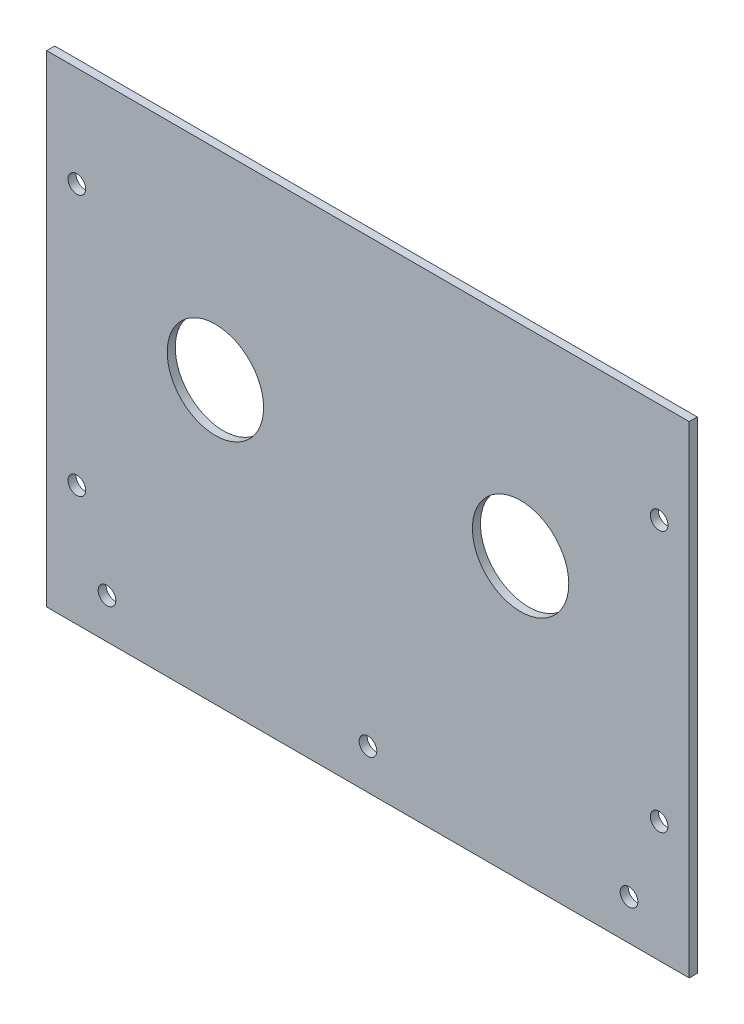
ISO-10303-21;
HEADER;
FILE_DESCRIPTION(('STEP AP214'),'2;1');
FILE_NAME('part.step','',(''),(''),'','','');
FILE_SCHEMA(('AUTOMOTIVE_DESIGN { 1 0 10303 214 1 1 1 1 }'));
ENDSEC;
DATA;
#1=APPLICATION_CONTEXT('core data for automotive mechanical design processes');
#2=APPLICATION_PROTOCOL_DEFINITION('international standard','automotive_design',2000,#1);
#3=PRODUCT_CONTEXT('',#1,'mechanical');
#4=PRODUCT('Part','Part','',(#3));
#5=PRODUCT_RELATED_PRODUCT_CATEGORY('part','',(#4));
#6=PRODUCT_DEFINITION_FORMATION('','',#4);
#7=PRODUCT_DEFINITION_CONTEXT('part definition',#1,'design');
#8=PRODUCT_DEFINITION('design','',#6,#7);
#9=PRODUCT_DEFINITION_SHAPE('','',#8);
#10=(LENGTH_UNIT() NAMED_UNIT(*) SI_UNIT(.MILLI.,.METRE.));
#11=(NAMED_UNIT(*) PLANE_ANGLE_UNIT() SI_UNIT($,.RADIAN.));
#12=(NAMED_UNIT(*) SI_UNIT($,.STERADIAN.) SOLID_ANGLE_UNIT());
#13=UNCERTAINTY_MEASURE_WITH_UNIT(LENGTH_MEASURE(1.E-05),#10,'distance_accuracy_value','');
#14=(GEOMETRIC_REPRESENTATION_CONTEXT(3) GLOBAL_UNCERTAINTY_ASSIGNED_CONTEXT((#13)) GLOBAL_UNIT_ASSIGNED_CONTEXT((#10,
#11,#12)) REPRESENTATION_CONTEXT('',''));
#15=CARTESIAN_POINT('',(0.,0.,0.));
#16=DIRECTION('',(0.,0.,1.));
#17=DIRECTION('',(1.,0.,0.));
#18=AXIS2_PLACEMENT_3D('',#15,#16,#17);
#19=CARTESIAN_POINT('',(80.,60.,2.));
#20=DIRECTION('',(-1.,0.,0.));
#21=DIRECTION('',(0.,-1.,0.));
#22=AXIS2_PLACEMENT_3D('',#19,#20,#21);
#23=PLANE('',#22);
#24=DIRECTION('',(0.,1.,0.));
#25=VECTOR('',#24,1.);
#26=CARTESIAN_POINT('',(80.,60.,0.));
#27=LINE('',#26,#25);
#28=CARTESIAN_POINT('',(80.,-60.,0.));
#29=VERTEX_POINT('',#28);
#30=CARTESIAN_POINT('',(80.,60.,0.));
#31=VERTEX_POINT('',#30);
#32=EDGE_CURVE('E109',#29,#31,#27,.T.);
#33=ORIENTED_EDGE('',*,*,#32,.T.);
#34=DIRECTION('',(0.,0.,-1.));
#35=VECTOR('',#34,1.);
#36=CARTESIAN_POINT('',(80.,60.,2.));
#37=LINE('',#36,#35);
#38=CARTESIAN_POINT('',(80.,60.,2.));
#39=VERTEX_POINT('',#38);
#40=EDGE_CURVE('E11',#39,#31,#37,.T.);
#41=ORIENTED_EDGE('',*,*,#40,.F.);
#42=DIRECTION('',(0.,1.,0.));
#43=VECTOR('',#42,1.);
#44=CARTESIAN_POINT('',(80.,60.,2.));
#45=LINE('',#44,#43);
#46=CARTESIAN_POINT('',(80.,-60.,2.));
#47=VERTEX_POINT('',#46);
#48=EDGE_CURVE('E92',#47,#39,#45,.T.);
#49=ORIENTED_EDGE('',*,*,#48,.F.);
#50=DIRECTION('',(0.,0.,-1.));
#51=VECTOR('',#50,1.);
#52=CARTESIAN_POINT('',(80.,-60.,2.));
#53=LINE('',#52,#51);
#54=EDGE_CURVE('E105',#47,#29,#53,.T.);
#55=ORIENTED_EDGE('',*,*,#54,.T.);
#56=EDGE_LOOP('',(#33,#41,#49,#55));
#57=FACE_BOUND('',#56,.T.);
#58=ADVANCED_FACE('F38',(#57),#23,.F.);
#59=CARTESIAN_POINT('',(-80.,60.,2.));
#60=DIRECTION('',(0.,-1.,0.));
#61=DIRECTION('',(0.,0.,-1.));
#62=AXIS2_PLACEMENT_3D('',#59,#60,#61);
#63=PLANE('',#62);
#64=DIRECTION('',(-1.,0.,0.));
#65=VECTOR('',#64,1.);
#66=CARTESIAN_POINT('',(-80.,60.,0.));
#67=LINE('',#66,#65);
#68=CARTESIAN_POINT('',(-80.,60.,0.));
#69=VERTEX_POINT('',#68);
#70=EDGE_CURVE('E97',#31,#69,#67,.T.);
#71=ORIENTED_EDGE('',*,*,#70,.T.);
#72=DIRECTION('',(0.,0.,-1.));
#73=VECTOR('',#72,1.);
#74=CARTESIAN_POINT('',(-80.,60.,2.));
#75=LINE('',#74,#73);
#76=CARTESIAN_POINT('',(-80.,60.,2.));
#77=VERTEX_POINT('',#76);
#78=EDGE_CURVE('E48',#77,#69,#75,.T.);
#79=ORIENTED_EDGE('',*,*,#78,.F.);
#80=DIRECTION('',(-1.,0.,0.));
#81=VECTOR('',#80,1.);
#82=CARTESIAN_POINT('',(-80.,60.,2.));
#83=LINE('',#82,#81);
#84=EDGE_CURVE('E87',#39,#77,#83,.T.);
#85=ORIENTED_EDGE('',*,*,#84,.F.);
#86=ORIENTED_EDGE('',*,*,#40,.T.);
#87=EDGE_LOOP('',(#71,#79,#85,#86));
#88=FACE_BOUND('',#87,.T.);
#89=ADVANCED_FACE('F96',(#88),#63,.F.);
#90=CARTESIAN_POINT('',(-80.,60.,2.));
#91=DIRECTION('',(1.,0.,0.));
#92=DIRECTION('',(0.,1.,0.));
#93=AXIS2_PLACEMENT_3D('',#90,#91,#92);
#94=PLANE('',#93);
#95=DIRECTION('',(0.,-1.,0.));
#96=VECTOR('',#95,1.);
#97=CARTESIAN_POINT('',(-80.,60.,0.));
#98=LINE('',#97,#96);
#99=CARTESIAN_POINT('',(-80.,-60.,0.));
#100=VERTEX_POINT('',#99);
#101=EDGE_CURVE('E74',#69,#100,#98,.T.);
#102=ORIENTED_EDGE('',*,*,#101,.T.);
#103=DIRECTION('',(0.,0.,-1.));
#104=VECTOR('',#103,1.);
#105=CARTESIAN_POINT('',(-80.,-60.,2.));
#106=LINE('',#105,#104);
#107=CARTESIAN_POINT('',(-80.,-60.,2.));
#108=VERTEX_POINT('',#107);
#109=EDGE_CURVE('E99',#108,#100,#106,.T.);
#110=ORIENTED_EDGE('',*,*,#109,.F.);
#111=DIRECTION('',(0.,-1.,0.));
#112=VECTOR('',#111,1.);
#113=CARTESIAN_POINT('',(-80.,60.,2.));
#114=LINE('',#113,#112);
#115=EDGE_CURVE('E90',#77,#108,#114,.T.);
#116=ORIENTED_EDGE('',*,*,#115,.F.);
#117=ORIENTED_EDGE('',*,*,#78,.T.);
#118=EDGE_LOOP('',(#102,#110,#116,#117));
#119=FACE_BOUND('',#118,.T.);
#120=ADVANCED_FACE('F101',(#119),#94,.F.);
#121=CARTESIAN_POINT('',(-80.,-60.,2.));
#122=DIRECTION('',(0.,1.,0.));
#123=DIRECTION('',(0.,0.,1.));
#124=AXIS2_PLACEMENT_3D('',#121,#122,#123);
#125=PLANE('',#124);
#126=DIRECTION('',(1.,0.,0.));
#127=VECTOR('',#126,1.);
#128=CARTESIAN_POINT('',(-80.,-60.,0.));
#129=LINE('',#128,#127);
#130=EDGE_CURVE('E80',#100,#29,#129,.T.);
#131=ORIENTED_EDGE('',*,*,#130,.T.);
#132=ORIENTED_EDGE('',*,*,#54,.F.);
#133=DIRECTION('',(1.,0.,0.));
#134=VECTOR('',#133,1.);
#135=CARTESIAN_POINT('',(-80.,-60.,2.));
#136=LINE('',#135,#134);
#137=EDGE_CURVE('E57',#108,#47,#136,.T.);
#138=ORIENTED_EDGE('',*,*,#137,.F.);
#139=ORIENTED_EDGE('',*,*,#109,.T.);
#140=EDGE_LOOP('',(#131,#132,#138,#139));
#141=FACE_BOUND('',#140,.T.);
#142=ADVANCED_FACE('F208',(#141),#125,.F.);
#143=CARTESIAN_POINT('',(0.,0.,2.));
#144=DIRECTION('',(0.,0.,1.));
#145=DIRECTION('',(1.,0.,0.));
#146=AXIS2_PLACEMENT_3D('',#143,#144,#145);
#147=PLANE('',#146);
#148=CARTESIAN_POINT('',(-72.5,-30.,2.));
#149=DIRECTION('',(0.,0.,1.));
#150=DIRECTION('',(1.,0.,0.));
#151=AXIS2_PLACEMENT_3D('',#148,#149,#150);
#152=CIRCLE('',#151,2.2);
#153=CARTESIAN_POINT('',(-70.3,-30.,2.));
#154=VERTEX_POINT('',#153);
#155=EDGE_CURVE('E190',#154,#154,#152,.T.);
#156=ORIENTED_EDGE('',*,*,#155,.F.);
#157=EDGE_LOOP('',(#156));
#158=FACE_BOUND('',#157,.T.);
#159=CARTESIAN_POINT('',(-72.5,35.,2.));
#160=DIRECTION('',(0.,0.,1.));
#161=DIRECTION('',(1.,0.,0.));
#162=AXIS2_PLACEMENT_3D('',#159,#160,#161);
#163=CIRCLE('',#162,2.20000000000001);
#164=CARTESIAN_POINT('',(-70.3,35.,2.));
#165=VERTEX_POINT('',#164);
#166=EDGE_CURVE('E194',#165,#165,#163,.T.);
#167=ORIENTED_EDGE('',*,*,#166,.F.);
#168=EDGE_LOOP('',(#167));
#169=FACE_BOUND('',#168,.T.);
#170=CARTESIAN_POINT('',(72.5,35.,2.));
#171=DIRECTION('',(0.,0.,1.));
#172=DIRECTION('',(1.,0.,0.));
#173=AXIS2_PLACEMENT_3D('',#170,#171,#172);
#174=CIRCLE('',#173,2.2);
#175=CARTESIAN_POINT('',(74.7,35.,2.));
#176=VERTEX_POINT('',#175);
#177=EDGE_CURVE('E189',#176,#176,#174,.T.);
#178=ORIENTED_EDGE('',*,*,#177,.F.);
#179=EDGE_LOOP('',(#178));
#180=FACE_BOUND('',#179,.T.);
#181=CARTESIAN_POINT('',(72.5,-30.,2.));
#182=DIRECTION('',(0.,0.,1.));
#183=DIRECTION('',(1.,0.,0.));
#184=AXIS2_PLACEMENT_3D('',#181,#182,#183);
#185=CIRCLE('',#184,2.2);
#186=CARTESIAN_POINT('',(74.7,-30.,2.));
#187=VERTEX_POINT('',#186);
#188=EDGE_CURVE('E129',#187,#187,#185,.T.);
#189=ORIENTED_EDGE('',*,*,#188,.F.);
#190=EDGE_LOOP('',(#189));
#191=FACE_BOUND('',#190,.T.);
#192=CARTESIAN_POINT('',(-38.,10.,2.));
#193=DIRECTION('',(0.,0.,1.));
#194=DIRECTION('',(1.,0.,0.));
#195=AXIS2_PLACEMENT_3D('',#192,#193,#194);
#196=CIRCLE('',#195,12.);
#197=CARTESIAN_POINT('',(-26.,10.,2.));
#198=VERTEX_POINT('',#197);
#199=EDGE_CURVE('E154',#198,#198,#196,.T.);
#200=ORIENTED_EDGE('',*,*,#199,.F.);
#201=EDGE_LOOP('',(#200));
#202=FACE_BOUND('',#201,.T.);
#203=CARTESIAN_POINT('',(65.,-50.,2.));
#204=DIRECTION('',(0.,0.,1.));
#205=DIRECTION('',(1.,0.,0.));
#206=AXIS2_PLACEMENT_3D('',#203,#204,#205);
#207=CIRCLE('',#206,2.20000000000001);
#208=CARTESIAN_POINT('',(67.2,-50.,2.));
#209=VERTEX_POINT('',#208);
#210=EDGE_CURVE('E163',#209,#209,#207,.T.);
#211=ORIENTED_EDGE('',*,*,#210,.F.);
#212=EDGE_LOOP('',(#211));
#213=FACE_BOUND('',#212,.T.);
#214=CARTESIAN_POINT('',(0.,-50.,2.));
#215=DIRECTION('',(0.,0.,1.));
#216=DIRECTION('',(1.,0.,0.));
#217=AXIS2_PLACEMENT_3D('',#214,#215,#216);
#218=CIRCLE('',#217,2.2);
#219=CARTESIAN_POINT('',(2.20000000000001,-50.,2.));
#220=VERTEX_POINT('',#219);
#221=EDGE_CURVE('E171',#220,#220,#218,.T.);
#222=ORIENTED_EDGE('',*,*,#221,.F.);
#223=EDGE_LOOP('',(#222));
#224=FACE_BOUND('',#223,.T.);
#225=CARTESIAN_POINT('',(-65.,-50.,2.));
#226=DIRECTION('',(0.,0.,1.));
#227=DIRECTION('',(1.,0.,0.));
#228=AXIS2_PLACEMENT_3D('',#225,#226,#227);
#229=CIRCLE('',#228,2.2);
#230=CARTESIAN_POINT('',(-62.8,-50.,2.));
#231=VERTEX_POINT('',#230);
#232=EDGE_CURVE('E144',#231,#231,#229,.T.);
#233=ORIENTED_EDGE('',*,*,#232,.F.);
#234=EDGE_LOOP('',(#233));
#235=FACE_BOUND('',#234,.T.);
#236=CARTESIAN_POINT('',(38.,10.,2.));
#237=DIRECTION('',(0.,0.,1.));
#238=DIRECTION('',(1.,0.,0.));
#239=AXIS2_PLACEMENT_3D('',#236,#237,#238);
#240=CIRCLE('',#239,12.);
#241=CARTESIAN_POINT('',(50.,10.,2.));
#242=VERTEX_POINT('',#241);
#243=EDGE_CURVE('E158',#242,#242,#240,.T.);
#244=ORIENTED_EDGE('',*,*,#243,.F.);
#245=EDGE_LOOP('',(#244));
#246=FACE_BOUND('',#245,.T.);
#247=ORIENTED_EDGE('',*,*,#48,.T.);
#248=ORIENTED_EDGE('',*,*,#84,.T.);
#249=ORIENTED_EDGE('',*,*,#115,.T.);
#250=ORIENTED_EDGE('',*,*,#137,.T.);
#251=EDGE_LOOP('',(#247,#248,#249,#250));
#252=FACE_BOUND('',#251,.T.);
#253=ADVANCED_FACE('F88',(#158,#169,#180,#191,#202,#213,#224,#235,#246,#252),#147,.T.);
#254=CARTESIAN_POINT('',(0.,0.,0.));
#255=DIRECTION('',(0.,0.,1.));
#256=DIRECTION('',(1.,0.,0.));
#257=AXIS2_PLACEMENT_3D('',#254,#255,#256);
#258=PLANE('',#257);
#259=CARTESIAN_POINT('',(-72.5,-30.,0.));
#260=DIRECTION('',(0.,0.,1.));
#261=DIRECTION('',(1.,0.,0.));
#262=AXIS2_PLACEMENT_3D('',#259,#260,#261);
#263=CIRCLE('',#262,2.2);
#264=CARTESIAN_POINT('',(-70.3,-30.,0.));
#265=VERTEX_POINT('',#264);
#266=EDGE_CURVE('E41',#265,#265,#263,.T.);
#267=ORIENTED_EDGE('',*,*,#266,.T.);
#268=EDGE_LOOP('',(#267));
#269=FACE_BOUND('',#268,.T.);
#270=CARTESIAN_POINT('',(-72.5,35.,0.));
#271=DIRECTION('',(0.,0.,1.));
#272=DIRECTION('',(1.,0.,0.));
#273=AXIS2_PLACEMENT_3D('',#270,#271,#272);
#274=CIRCLE('',#273,2.20000000000001);
#275=CARTESIAN_POINT('',(-70.3,35.,0.));
#276=VERTEX_POINT('',#275);
#277=EDGE_CURVE('E132',#276,#276,#274,.T.);
#278=ORIENTED_EDGE('',*,*,#277,.T.);
#279=EDGE_LOOP('',(#278));
#280=FACE_BOUND('',#279,.T.);
#281=CARTESIAN_POINT('',(72.5,35.,0.));
#282=DIRECTION('',(0.,0.,1.));
#283=DIRECTION('',(1.,0.,0.));
#284=AXIS2_PLACEMENT_3D('',#281,#282,#283);
#285=CIRCLE('',#284,2.2);
#286=CARTESIAN_POINT('',(74.7,35.,0.));
#287=VERTEX_POINT('',#286);
#288=EDGE_CURVE('E128',#287,#287,#285,.T.);
#289=ORIENTED_EDGE('',*,*,#288,.T.);
#290=EDGE_LOOP('',(#289));
#291=FACE_BOUND('',#290,.T.);
#292=CARTESIAN_POINT('',(72.5,-30.,0.));
#293=DIRECTION('',(0.,0.,1.));
#294=DIRECTION('',(1.,0.,0.));
#295=AXIS2_PLACEMENT_3D('',#292,#293,#294);
#296=CIRCLE('',#295,2.2);
#297=CARTESIAN_POINT('',(74.7,-30.,0.));
#298=VERTEX_POINT('',#297);
#299=EDGE_CURVE('E124',#298,#298,#296,.T.);
#300=ORIENTED_EDGE('',*,*,#299,.T.);
#301=EDGE_LOOP('',(#300));
#302=FACE_BOUND('',#301,.T.);
#303=CARTESIAN_POINT('',(-38.,10.,0.));
#304=DIRECTION('',(0.,0.,1.));
#305=DIRECTION('',(1.,0.,0.));
#306=AXIS2_PLACEMENT_3D('',#303,#304,#305);
#307=CIRCLE('',#306,12.);
#308=CARTESIAN_POINT('',(-26.,10.,0.));
#309=VERTEX_POINT('',#308);
#310=EDGE_CURVE('E159',#309,#309,#307,.T.);
#311=ORIENTED_EDGE('',*,*,#310,.T.);
#312=EDGE_LOOP('',(#311));
#313=FACE_BOUND('',#312,.T.);
#314=CARTESIAN_POINT('',(65.,-50.,0.));
#315=DIRECTION('',(0.,0.,1.));
#316=DIRECTION('',(1.,0.,0.));
#317=AXIS2_PLACEMENT_3D('',#314,#315,#316);
#318=CIRCLE('',#317,2.20000000000001);
#319=CARTESIAN_POINT('',(67.2,-50.,0.));
#320=VERTEX_POINT('',#319);
#321=EDGE_CURVE('E167',#320,#320,#318,.T.);
#322=ORIENTED_EDGE('',*,*,#321,.T.);
#323=EDGE_LOOP('',(#322));
#324=FACE_BOUND('',#323,.T.);
#325=CARTESIAN_POINT('',(0.,-50.,0.));
#326=DIRECTION('',(0.,0.,1.));
#327=DIRECTION('',(1.,0.,0.));
#328=AXIS2_PLACEMENT_3D('',#325,#326,#327);
#329=CIRCLE('',#328,2.2);
#330=CARTESIAN_POINT('',(2.20000000000001,-50.,0.));
#331=VERTEX_POINT('',#330);
#332=EDGE_CURVE('E150',#331,#331,#329,.T.);
#333=ORIENTED_EDGE('',*,*,#332,.T.);
#334=EDGE_LOOP('',(#333));
#335=FACE_BOUND('',#334,.T.);
#336=CARTESIAN_POINT('',(-65.,-50.,0.));
#337=DIRECTION('',(0.,0.,1.));
#338=DIRECTION('',(1.,0.,0.));
#339=AXIS2_PLACEMENT_3D('',#336,#337,#338);
#340=CIRCLE('',#339,2.2);
#341=CARTESIAN_POINT('',(-62.8,-50.,0.));
#342=VERTEX_POINT('',#341);
#343=EDGE_CURVE('E139',#342,#342,#340,.T.);
#344=ORIENTED_EDGE('',*,*,#343,.T.);
#345=EDGE_LOOP('',(#344));
#346=FACE_BOUND('',#345,.T.);
#347=CARTESIAN_POINT('',(38.,10.,0.));
#348=DIRECTION('',(0.,0.,1.));
#349=DIRECTION('',(1.,0.,0.));
#350=AXIS2_PLACEMENT_3D('',#347,#348,#349);
#351=CIRCLE('',#350,12.);
#352=CARTESIAN_POINT('',(50.,10.,0.));
#353=VERTEX_POINT('',#352);
#354=EDGE_CURVE('E113',#353,#353,#351,.T.);
#355=ORIENTED_EDGE('',*,*,#354,.T.);
#356=EDGE_LOOP('',(#355));
#357=FACE_BOUND('',#356,.T.);
#358=ORIENTED_EDGE('',*,*,#32,.F.);
#359=ORIENTED_EDGE('',*,*,#130,.F.);
#360=ORIENTED_EDGE('',*,*,#101,.F.);
#361=ORIENTED_EDGE('',*,*,#70,.F.);
#362=EDGE_LOOP('',(#358,#359,#360,#361));
#363=FACE_BOUND('',#362,.T.);
#364=ADVANCED_FACE('F207',(#269,#280,#291,#302,#313,#324,#335,#346,#357,#363),#258,.F.);
#365=CARTESIAN_POINT('',(38.,10.,0.));
#366=DIRECTION('',(0.,0.,1.));
#367=DIRECTION('',(1.,0.,0.));
#368=AXIS2_PLACEMENT_3D('',#365,#366,#367);
#369=CYLINDRICAL_SURFACE('',#368,12.);
#370=ORIENTED_EDGE('',*,*,#354,.F.);
#371=EDGE_LOOP('',(#370));
#372=FACE_BOUND('',#371,.T.);
#373=ORIENTED_EDGE('',*,*,#243,.T.);
#374=EDGE_LOOP('',(#373));
#375=FACE_BOUND('',#374,.T.);
#376=ADVANCED_FACE('F223',(#372,#375),#369,.F.);
#377=CARTESIAN_POINT('',(-65.,-50.,0.));
#378=DIRECTION('',(0.,0.,1.));
#379=DIRECTION('',(1.,0.,0.));
#380=AXIS2_PLACEMENT_3D('',#377,#378,#379);
#381=CYLINDRICAL_SURFACE('',#380,2.2);
#382=ORIENTED_EDGE('',*,*,#343,.F.);
#383=EDGE_LOOP('',(#382));
#384=FACE_BOUND('',#383,.T.);
#385=ORIENTED_EDGE('',*,*,#232,.T.);
#386=EDGE_LOOP('',(#385));
#387=FACE_BOUND('',#386,.T.);
#388=ADVANCED_FACE('F225',(#384,#387),#381,.F.);
#389=CARTESIAN_POINT('',(0.,-50.,0.));
#390=DIRECTION('',(0.,0.,1.));
#391=DIRECTION('',(1.,0.,0.));
#392=AXIS2_PLACEMENT_3D('',#389,#390,#391);
#393=CYLINDRICAL_SURFACE('',#392,2.2);
#394=ORIENTED_EDGE('',*,*,#332,.F.);
#395=EDGE_LOOP('',(#394));
#396=FACE_BOUND('',#395,.T.);
#397=ORIENTED_EDGE('',*,*,#221,.T.);
#398=EDGE_LOOP('',(#397));
#399=FACE_BOUND('',#398,.T.);
#400=ADVANCED_FACE('F232',(#396,#399),#393,.F.);
#401=CARTESIAN_POINT('',(65.,-50.,0.));
#402=DIRECTION('',(0.,0.,1.));
#403=DIRECTION('',(1.,0.,0.));
#404=AXIS2_PLACEMENT_3D('',#401,#402,#403);
#405=CYLINDRICAL_SURFACE('',#404,2.20000000000001);
#406=ORIENTED_EDGE('',*,*,#321,.F.);
#407=EDGE_LOOP('',(#406));
#408=FACE_BOUND('',#407,.T.);
#409=ORIENTED_EDGE('',*,*,#210,.T.);
#410=EDGE_LOOP('',(#409));
#411=FACE_BOUND('',#410,.T.);
#412=ADVANCED_FACE('F296',(#408,#411),#405,.F.);
#413=CARTESIAN_POINT('',(-38.,10.,0.));
#414=DIRECTION('',(0.,0.,1.));
#415=DIRECTION('',(1.,0.,0.));
#416=AXIS2_PLACEMENT_3D('',#413,#414,#415);
#417=CYLINDRICAL_SURFACE('',#416,12.);
#418=ORIENTED_EDGE('',*,*,#310,.F.);
#419=EDGE_LOOP('',(#418));
#420=FACE_BOUND('',#419,.T.);
#421=ORIENTED_EDGE('',*,*,#199,.T.);
#422=EDGE_LOOP('',(#421));
#423=FACE_BOUND('',#422,.T.);
#424=ADVANCED_FACE('F305',(#420,#423),#417,.F.);
#425=CARTESIAN_POINT('',(72.5,-30.,-103.));
#426=DIRECTION('',(0.,0.,1.));
#427=DIRECTION('',(1.,0.,0.));
#428=AXIS2_PLACEMENT_3D('',#425,#426,#427);
#429=CYLINDRICAL_SURFACE('',#428,2.2);
#430=ORIENTED_EDGE('',*,*,#188,.T.);
#431=EDGE_LOOP('',(#430));
#432=FACE_BOUND('',#431,.T.);
#433=ORIENTED_EDGE('',*,*,#299,.F.);
#434=EDGE_LOOP('',(#433));
#435=FACE_BOUND('',#434,.T.);
#436=ADVANCED_FACE('F313',(#432,#435),#429,.F.);
#437=CARTESIAN_POINT('',(72.5,35.,-103.));
#438=DIRECTION('',(0.,0.,1.));
#439=DIRECTION('',(1.,0.,0.));
#440=AXIS2_PLACEMENT_3D('',#437,#438,#439);
#441=CYLINDRICAL_SURFACE('',#440,2.2);
#442=ORIENTED_EDGE('',*,*,#177,.T.);
#443=EDGE_LOOP('',(#442));
#444=FACE_BOUND('',#443,.T.);
#445=ORIENTED_EDGE('',*,*,#288,.F.);
#446=EDGE_LOOP('',(#445));
#447=FACE_BOUND('',#446,.T.);
#448=ADVANCED_FACE('F202',(#444,#447),#441,.F.);
#449=CARTESIAN_POINT('',(-72.5,35.,-103.));
#450=DIRECTION('',(0.,0.,1.));
#451=DIRECTION('',(1.,0.,0.));
#452=AXIS2_PLACEMENT_3D('',#449,#450,#451);
#453=CYLINDRICAL_SURFACE('',#452,2.20000000000001);
#454=ORIENTED_EDGE('',*,*,#166,.T.);
#455=EDGE_LOOP('',(#454));
#456=FACE_BOUND('',#455,.T.);
#457=ORIENTED_EDGE('',*,*,#277,.F.);
#458=EDGE_LOOP('',(#457));
#459=FACE_BOUND('',#458,.T.);
#460=ADVANCED_FACE('F330',(#456,#459),#453,.F.);
#461=CARTESIAN_POINT('',(-72.5,-30.,-103.));
#462=DIRECTION('',(0.,0.,1.));
#463=DIRECTION('',(1.,0.,0.));
#464=AXIS2_PLACEMENT_3D('',#461,#462,#463);
#465=CYLINDRICAL_SURFACE('',#464,2.2);
#466=ORIENTED_EDGE('',*,*,#155,.T.);
#467=EDGE_LOOP('',(#466));
#468=FACE_BOUND('',#467,.T.);
#469=ORIENTED_EDGE('',*,*,#266,.F.);
#470=EDGE_LOOP('',(#469));
#471=FACE_BOUND('',#470,.T.);
#472=ADVANCED_FACE('F338',(#468,#471),#465,.F.);
#473=CLOSED_SHELL('',(#58,#89,#120,#142,#253,#364,#376,#388,#400,#412,#424,#436,#448,#460,#472));
#474=MANIFOLD_SOLID_BREP('B2',#473);
#475=ADVANCED_BREP_SHAPE_REPRESENTATION('',(#18,#474),#14);
#476=SHAPE_DEFINITION_REPRESENTATION(#9,#475);
ENDSEC;
END-ISO-10303-21;
